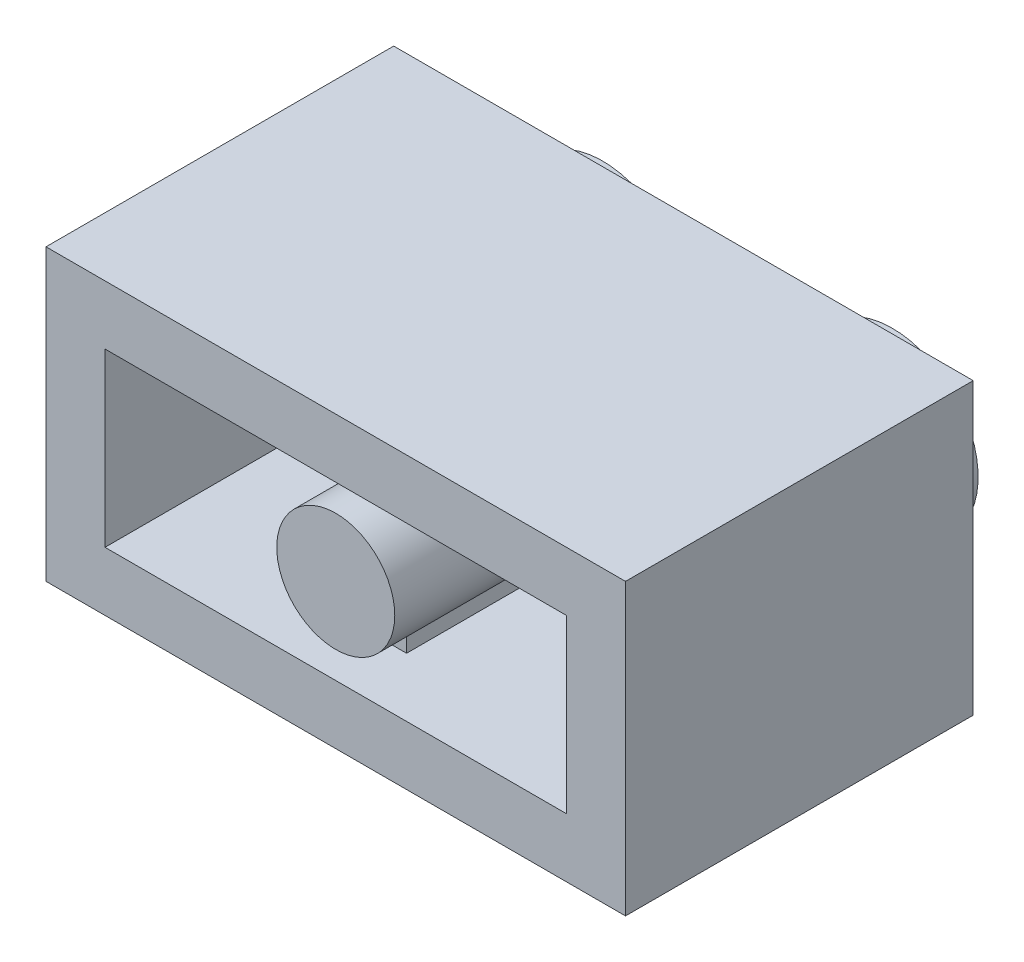
ISO-10303-21;
HEADER;
FILE_DESCRIPTION(('STEP AP214'),'2;1');
FILE_NAME('part.step','',(''),(''),'','','');
FILE_SCHEMA(('AUTOMOTIVE_DESIGN { 1 0 10303 214 1 1 1 1 }'));
ENDSEC;
DATA;
#1=APPLICATION_CONTEXT('core data for automotive mechanical design processes');
#2=APPLICATION_PROTOCOL_DEFINITION('international standard','automotive_design',2000,#1);
#3=PRODUCT_CONTEXT('',#1,'mechanical');
#4=PRODUCT('Part','Part','',(#3));
#5=PRODUCT_RELATED_PRODUCT_CATEGORY('part','',(#4));
#6=PRODUCT_DEFINITION_FORMATION('','',#4);
#7=PRODUCT_DEFINITION_CONTEXT('part definition',#1,'design');
#8=PRODUCT_DEFINITION('design','',#6,#7);
#9=PRODUCT_DEFINITION_SHAPE('','',#8);
#10=(LENGTH_UNIT() NAMED_UNIT(*) SI_UNIT(.MILLI.,.METRE.));
#11=(NAMED_UNIT(*) PLANE_ANGLE_UNIT() SI_UNIT($,.RADIAN.));
#12=(NAMED_UNIT(*) SI_UNIT($,.STERADIAN.) SOLID_ANGLE_UNIT());
#13=UNCERTAINTY_MEASURE_WITH_UNIT(LENGTH_MEASURE(1.E-05),#10,'distance_accuracy_value','');
#14=(GEOMETRIC_REPRESENTATION_CONTEXT(3) GLOBAL_UNCERTAINTY_ASSIGNED_CONTEXT((#13)) GLOBAL_UNIT_ASSIGNED_CONTEXT((#10,
#11,#12)) REPRESENTATION_CONTEXT('',''));
#15=CARTESIAN_POINT('',(0.,0.,0.));
#16=DIRECTION('',(0.,0.,1.));
#17=DIRECTION('',(1.,0.,0.));
#18=AXIS2_PLACEMENT_3D('',#15,#16,#17);
#19=CARTESIAN_POINT('',(0.,-4.0325,4.839));
#20=DIRECTION('',(0.,0.,1.));
#21=DIRECTION('',(1.,0.,0.));
#22=AXIS2_PLACEMENT_3D('',#19,#20,#21);
#23=PLANE('',#22);
#24=CARTESIAN_POINT('',(0.,0.,4.839));
#25=DIRECTION('',(0.,0.,1.));
#26=DIRECTION('',(1.,0.,0.));
#27=AXIS2_PLACEMENT_3D('',#24,#25,#26);
#28=CIRCLE('',#27,1.6425);
#29=CARTESIAN_POINT('',(1.6425,0.,4.839));
#30=VERTEX_POINT('',#29);
#31=EDGE_CURVE('E19',#30,#30,#28,.F.);
#32=ORIENTED_EDGE('',*,*,#31,.F.);
#33=EDGE_LOOP('',(#32));
#34=FACE_BOUND('',#33,.T.);
#35=ADVANCED_FACE('F16',(#34),#23,.T.);
#36=CARTESIAN_POINT('',(8.065,-4.0325,-4.839));
#37=DIRECTION('',(0.,0.,-1.));
#38=DIRECTION('',(-1.,0.,0.));
#39=AXIS2_PLACEMENT_3D('',#36,#37,#38);
#40=PLANE('',#39);
#41=CARTESIAN_POINT('',(-4.0325,0.,-4.839));
#42=DIRECTION('',(0.,0.,-1.));
#43=DIRECTION('',(-1.,0.,0.));
#44=AXIS2_PLACEMENT_3D('',#41,#42,#43);
#45=CIRCLE('',#44,1.6425);
#46=CARTESIAN_POINT('',(-5.675,0.,-4.839));
#47=VERTEX_POINT('',#46);
#48=EDGE_CURVE('E136',#47,#47,#45,.T.);
#49=ORIENTED_EDGE('',*,*,#48,.T.);
#50=EDGE_LOOP('',(#49));
#51=FACE_BOUND('',#50,.T.);
#52=ADVANCED_FACE('F271',(#51),#40,.T.);
#53=CARTESIAN_POINT('',(8.065,-4.0325,-4.839));
#54=DIRECTION('',(0.,0.,-1.));
#55=DIRECTION('',(-1.,0.,0.));
#56=AXIS2_PLACEMENT_3D('',#53,#54,#55);
#57=PLANE('',#56);
#58=CARTESIAN_POINT('',(4.0325,0.,-4.839));
#59=DIRECTION('',(0.,0.,-1.));
#60=DIRECTION('',(-1.,0.,0.));
#61=AXIS2_PLACEMENT_3D('',#58,#59,#60);
#62=CIRCLE('',#61,1.6425);
#63=CARTESIAN_POINT('',(2.39,0.,-4.839));
#64=VERTEX_POINT('',#63);
#65=EDGE_CURVE('E265',#64,#64,#62,.T.);
#66=ORIENTED_EDGE('',*,*,#65,.T.);
#67=EDGE_LOOP('',(#66));
#68=FACE_BOUND('',#67,.T.);
#69=ADVANCED_FACE('F286',(#68),#57,.T.);
#70=CARTESIAN_POINT('',(0.,0.,4.839));
#71=DIRECTION('',(0.,0.,1.));
#72=DIRECTION('',(1.,0.,0.));
#73=AXIS2_PLACEMENT_3D('',#70,#71,#72);
#74=CYLINDRICAL_SURFACE('',#73,1.6425);
#75=ORIENTED_EDGE('',*,*,#31,.T.);
#76=EDGE_LOOP('',(#75));
#77=FACE_BOUND('',#76,.T.);
#78=DIRECTION('',(0.,0.,1.));
#79=VECTOR('',#78,1.);
#80=CARTESIAN_POINT('',(-0.3285,-1.60931476100855,-3.1965));
#81=LINE('',#80,#79);
#82=CARTESIAN_POINT('',(-0.3285,-1.60931476100855,3.1965));
#83=VERTEX_POINT('',#82);
#84=CARTESIAN_POINT('',(-0.328500000000001,-1.60931476100855,-3.1965));
#85=VERTEX_POINT('',#84);
#86=EDGE_CURVE('E134',#83,#85,#81,.F.);
#87=ORIENTED_EDGE('',*,*,#86,.F.);
#88=CARTESIAN_POINT('',(0.,0.,3.1965));
#89=DIRECTION('',(0.,0.,1.));
#90=DIRECTION('',(1.,0.,0.));
#91=AXIS2_PLACEMENT_3D('',#88,#89,#90);
#92=CIRCLE('',#91,1.6425);
#93=CARTESIAN_POINT('',(0.3285,-1.60931476100855,3.1965));
#94=VERTEX_POINT('',#93);
#95=EDGE_CURVE('E125',#83,#94,#92,.T.);
#96=ORIENTED_EDGE('',*,*,#95,.T.);
#97=DIRECTION('',(0.,0.,-1.));
#98=VECTOR('',#97,1.);
#99=CARTESIAN_POINT('',(0.3285,-1.60931476100855,3.1965));
#100=LINE('',#99,#98);
#101=CARTESIAN_POINT('',(0.3285,-1.60931476100855,-3.1965));
#102=VERTEX_POINT('',#101);
#103=EDGE_CURVE('E132',#102,#94,#100,.F.);
#104=ORIENTED_EDGE('',*,*,#103,.F.);
#105=CARTESIAN_POINT('',(0.,0.,-3.1965));
#106=DIRECTION('',(0.,0.,1.));
#107=DIRECTION('',(1.,0.,0.));
#108=AXIS2_PLACEMENT_3D('',#105,#106,#107);
#109=CIRCLE('',#108,1.6425);
#110=CARTESIAN_POINT('',(0.3285,1.60931476100855,-3.1965));
#111=VERTEX_POINT('',#110);
#112=EDGE_CURVE('E161',#102,#111,#109,.T.);
#113=ORIENTED_EDGE('',*,*,#112,.T.);
#114=DIRECTION('',(0.,0.,-1.));
#115=VECTOR('',#114,1.);
#116=CARTESIAN_POINT('',(0.3285,1.60931476100855,3.1965));
#117=LINE('',#116,#115);
#118=CARTESIAN_POINT('',(0.3285,1.60931476100855,3.1965));
#119=VERTEX_POINT('',#118);
#120=EDGE_CURVE('E176',#119,#111,#117,.T.);
#121=ORIENTED_EDGE('',*,*,#120,.F.);
#122=CARTESIAN_POINT('',(0.,0.,3.1965));
#123=DIRECTION('',(0.,0.,1.));
#124=DIRECTION('',(1.,0.,0.));
#125=AXIS2_PLACEMENT_3D('',#122,#123,#124);
#126=CIRCLE('',#125,1.6425);
#127=CARTESIAN_POINT('',(-0.3285,1.60931476100855,3.1965));
#128=VERTEX_POINT('',#127);
#129=EDGE_CURVE('E216',#128,#119,#126,.F.);
#130=ORIENTED_EDGE('',*,*,#129,.F.);
#131=DIRECTION('',(0.,0.,1.));
#132=VECTOR('',#131,1.);
#133=CARTESIAN_POINT('',(-0.3285,1.60931476100855,-3.1965));
#134=LINE('',#133,#132);
#135=CARTESIAN_POINT('',(-0.328500000000001,1.60931476100855,-3.1965));
#136=VERTEX_POINT('',#135);
#137=EDGE_CURVE('E213',#136,#128,#134,.T.);
#138=ORIENTED_EDGE('',*,*,#137,.F.);
#139=CARTESIAN_POINT('',(0.,0.,-3.1965));
#140=DIRECTION('',(0.,0.,1.));
#141=DIRECTION('',(1.,0.,0.));
#142=AXIS2_PLACEMENT_3D('',#139,#140,#141);
#143=CIRCLE('',#142,1.6425);
#144=EDGE_CURVE('E167',#136,#85,#143,.T.);
#145=ORIENTED_EDGE('',*,*,#144,.T.);
#146=EDGE_LOOP('',(#87,#96,#104,#113,#121,#130,#138,#145));
#147=FACE_BOUND('',#146,.T.);
#148=ADVANCED_FACE('F130',(#77,#147),#74,.T.);
#149=CARTESIAN_POINT('',(-4.0325,0.,-4.839));
#150=DIRECTION('',(0.,0.,-1.));
#151=DIRECTION('',(-1.,0.,0.));
#152=AXIS2_PLACEMENT_3D('',#149,#150,#151);
#153=CYLINDRICAL_SURFACE('',#152,1.6425);
#154=CARTESIAN_POINT('',(-4.0325,0.,-6.619));
#155=DIRECTION('',(0.,0.,-1.));
#156=DIRECTION('',(-1.,0.,0.));
#157=AXIS2_PLACEMENT_3D('',#154,#155,#156);
#158=CIRCLE('',#157,1.6425);
#159=CARTESIAN_POINT('',(-5.675,0.,-6.619));
#160=VERTEX_POINT('',#159);
#161=EDGE_CURVE('E152',#160,#160,#158,.F.);
#162=ORIENTED_EDGE('',*,*,#161,.F.);
#163=EDGE_LOOP('',(#162));
#164=FACE_BOUND('',#163,.T.);
#165=ORIENTED_EDGE('',*,*,#48,.F.);
#166=EDGE_LOOP('',(#165));
#167=FACE_BOUND('',#166,.T.);
#168=ADVANCED_FACE('F273',(#164,#167),#153,.F.);
#169=CARTESIAN_POINT('',(4.0325,0.,-4.839));
#170=DIRECTION('',(0.,0.,-1.));
#171=DIRECTION('',(-1.,0.,0.));
#172=AXIS2_PLACEMENT_3D('',#169,#170,#171);
#173=CYLINDRICAL_SURFACE('',#172,1.6425);
#174=CARTESIAN_POINT('',(4.0325,0.,-6.619));
#175=DIRECTION('',(0.,0.,-1.));
#176=DIRECTION('',(-1.,0.,0.));
#177=AXIS2_PLACEMENT_3D('',#174,#175,#176);
#178=CIRCLE('',#177,1.6425);
#179=CARTESIAN_POINT('',(2.39,0.,-6.619));
#180=VERTEX_POINT('',#179);
#181=EDGE_CURVE('E257',#180,#180,#178,.F.);
#182=ORIENTED_EDGE('',*,*,#181,.F.);
#183=EDGE_LOOP('',(#182));
#184=FACE_BOUND('',#183,.T.);
#185=ORIENTED_EDGE('',*,*,#65,.F.);
#186=EDGE_LOOP('',(#185));
#187=FACE_BOUND('',#186,.T.);
#188=ADVANCED_FACE('F275',(#184,#187),#173,.F.);
#189=CARTESIAN_POINT('',(-0.3285,2.39,3.1965));
#190=DIRECTION('',(0.,0.,1.));
#191=DIRECTION('',(1.,0.,0.));
#192=AXIS2_PLACEMENT_3D('',#189,#190,#191);
#193=PLANE('',#192);
#194=DIRECTION('',(0.,1.,0.));
#195=VECTOR('',#194,1.);
#196=CARTESIAN_POINT('',(0.3285,2.39,3.1965));
#197=LINE('',#196,#195);
#198=CARTESIAN_POINT('',(0.3285,2.39,3.1965));
#199=VERTEX_POINT('',#198);
#200=EDGE_CURVE('E200',#199,#119,#197,.F.);
#201=ORIENTED_EDGE('',*,*,#200,.F.);
#202=DIRECTION('',(1.,0.,0.));
#203=VECTOR('',#202,1.);
#204=CARTESIAN_POINT('',(0.,2.39,3.1965));
#205=LINE('',#204,#203);
#206=CARTESIAN_POINT('',(-0.3285,2.39,3.1965));
#207=VERTEX_POINT('',#206);
#208=EDGE_CURVE('E225',#199,#207,#205,.F.);
#209=ORIENTED_EDGE('',*,*,#208,.T.);
#210=DIRECTION('',(0.,1.,0.));
#211=VECTOR('',#210,1.);
#212=CARTESIAN_POINT('',(-0.3285,2.39,3.1965));
#213=LINE('',#212,#211);
#214=EDGE_CURVE('E215',#128,#207,#213,.T.);
#215=ORIENTED_EDGE('',*,*,#214,.F.);
#216=ORIENTED_EDGE('',*,*,#129,.T.);
#217=EDGE_LOOP('',(#201,#209,#215,#216));
#218=FACE_BOUND('',#217,.T.);
#219=ADVANCED_FACE('F283',(#218),#193,.T.);
#220=CARTESIAN_POINT('',(-0.3285,2.39,-3.1965));
#221=DIRECTION('',(-1.,0.,0.));
#222=DIRECTION('',(0.,0.,1.));
#223=AXIS2_PLACEMENT_3D('',#220,#221,#222);
#224=PLANE('',#223);
#225=ORIENTED_EDGE('',*,*,#214,.T.);
#226=DIRECTION('',(0.,0.,1.));
#227=VECTOR('',#226,1.);
#228=CARTESIAN_POINT('',(-0.3285,2.39,0.));
#229=LINE('',#228,#227);
#230=CARTESIAN_POINT('',(-0.328500000000001,2.39,-3.1965));
#231=VERTEX_POINT('',#230);
#232=EDGE_CURVE('E220',#207,#231,#229,.F.);
#233=ORIENTED_EDGE('',*,*,#232,.T.);
#234=DIRECTION('',(0.,1.,0.));
#235=VECTOR('',#234,1.);
#236=CARTESIAN_POINT('',(-0.328500000000001,-4.0325,-3.1965));
#237=LINE('',#236,#235);
#238=EDGE_CURVE('E164',#231,#136,#237,.F.);
#239=ORIENTED_EDGE('',*,*,#238,.T.);
#240=ORIENTED_EDGE('',*,*,#137,.T.);
#241=EDGE_LOOP('',(#225,#233,#239,#240));
#242=FACE_BOUND('',#241,.T.);
#243=ADVANCED_FACE('F369',(#242),#224,.T.);
#244=CARTESIAN_POINT('',(0.3285,2.39,3.1965));
#245=DIRECTION('',(1.,0.,0.));
#246=DIRECTION('',(0.,0.,-1.));
#247=AXIS2_PLACEMENT_3D('',#244,#245,#246);
#248=PLANE('',#247);
#249=DIRECTION('',(0.,1.,0.));
#250=VECTOR('',#249,1.);
#251=CARTESIAN_POINT('',(0.3285,-4.0325,-3.1965));
#252=LINE('',#251,#250);
#253=CARTESIAN_POINT('',(0.3285,2.39,-3.1965));
#254=VERTEX_POINT('',#253);
#255=EDGE_CURVE('E159',#111,#254,#252,.T.);
#256=ORIENTED_EDGE('',*,*,#255,.T.);
#257=DIRECTION('',(0.,0.,1.));
#258=VECTOR('',#257,1.);
#259=CARTESIAN_POINT('',(0.3285,2.39,0.));
#260=LINE('',#259,#258);
#261=EDGE_CURVE('E201',#254,#199,#260,.T.);
#262=ORIENTED_EDGE('',*,*,#261,.T.);
#263=ORIENTED_EDGE('',*,*,#200,.T.);
#264=ORIENTED_EDGE('',*,*,#120,.T.);
#265=EDGE_LOOP('',(#256,#262,#263,#264));
#266=FACE_BOUND('',#265,.T.);
#267=ADVANCED_FACE('F365',(#266),#248,.T.);
#268=CARTESIAN_POINT('',(-0.3285,2.39,-3.1965));
#269=DIRECTION('',(-1.,0.,0.));
#270=DIRECTION('',(0.,0.,1.));
#271=AXIS2_PLACEMENT_3D('',#268,#269,#270);
#272=PLANE('',#271);
#273=DIRECTION('',(0.,1.,0.));
#274=VECTOR('',#273,1.);
#275=CARTESIAN_POINT('',(-0.328500000000001,-4.0325,-3.1965));
#276=LINE('',#275,#274);
#277=CARTESIAN_POINT('',(-0.3285,-2.39,-3.1965));
#278=VERTEX_POINT('',#277);
#279=EDGE_CURVE('E168',#85,#278,#276,.F.);
#280=ORIENTED_EDGE('',*,*,#279,.T.);
#281=DIRECTION('',(0.,0.,1.));
#282=VECTOR('',#281,1.);
#283=CARTESIAN_POINT('',(-0.3285,-2.39,0.));
#284=LINE('',#283,#282);
#285=CARTESIAN_POINT('',(-0.3285,-2.39,3.1965));
#286=VERTEX_POINT('',#285);
#287=EDGE_CURVE('E182',#286,#278,#284,.F.);
#288=ORIENTED_EDGE('',*,*,#287,.F.);
#289=DIRECTION('',(0.,1.,0.));
#290=VECTOR('',#289,1.);
#291=CARTESIAN_POINT('',(-0.3285,2.39,3.1965));
#292=LINE('',#291,#290);
#293=EDGE_CURVE('E150',#83,#286,#292,.F.);
#294=ORIENTED_EDGE('',*,*,#293,.F.);
#295=ORIENTED_EDGE('',*,*,#86,.T.);
#296=EDGE_LOOP('',(#280,#288,#294,#295));
#297=FACE_BOUND('',#296,.T.);
#298=ADVANCED_FACE('F361',(#297),#272,.T.);
#299=CARTESIAN_POINT('',(8.065,-4.0325,-3.1965));
#300=DIRECTION('',(0.,0.,-1.));
#301=DIRECTION('',(-1.,0.,0.));
#302=AXIS2_PLACEMENT_3D('',#299,#300,#301);
#303=PLANE('',#302);
#304=ORIENTED_EDGE('',*,*,#144,.F.);
#305=ORIENTED_EDGE('',*,*,#238,.F.);
#306=DIRECTION('',(1.,0.,0.));
#307=VECTOR('',#306,1.);
#308=CARTESIAN_POINT('',(0.,2.39,-3.1965));
#309=LINE('',#308,#307);
#310=CARTESIAN_POINT('',(-6.4225,2.39,-3.1965));
#311=VERTEX_POINT('',#310);
#312=EDGE_CURVE('E217',#231,#311,#309,.F.);
#313=ORIENTED_EDGE('',*,*,#312,.T.);
#314=DIRECTION('',(0.,1.,0.));
#315=VECTOR('',#314,1.);
#316=CARTESIAN_POINT('',(-6.4225,-4.0325,-3.1965));
#317=LINE('',#316,#315);
#318=CARTESIAN_POINT('',(-6.4225,-2.39,-3.1965));
#319=VERTEX_POINT('',#318);
#320=EDGE_CURVE('E238',#311,#319,#317,.F.);
#321=ORIENTED_EDGE('',*,*,#320,.T.);
#322=DIRECTION('',(1.,0.,0.));
#323=VECTOR('',#322,1.);
#324=CARTESIAN_POINT('',(0.,-2.39,-3.1965));
#325=LINE('',#324,#323);
#326=EDGE_CURVE('E184',#278,#319,#325,.F.);
#327=ORIENTED_EDGE('',*,*,#326,.F.);
#328=ORIENTED_EDGE('',*,*,#279,.F.);
#329=EDGE_LOOP('',(#304,#305,#313,#321,#327,#328));
#330=FACE_BOUND('',#329,.T.);
#331=ADVANCED_FACE('F357',(#330),#303,.F.);
#332=CARTESIAN_POINT('',(8.065,-4.0325,-3.1965));
#333=DIRECTION('',(0.,0.,-1.));
#334=DIRECTION('',(-1.,0.,0.));
#335=AXIS2_PLACEMENT_3D('',#332,#333,#334);
#336=PLANE('',#335);
#337=DIRECTION('',(0.,1.,0.));
#338=VECTOR('',#337,1.);
#339=CARTESIAN_POINT('',(6.4225,-4.0325,-3.1965));
#340=LINE('',#339,#338);
#341=CARTESIAN_POINT('',(6.4225,-2.39,-3.1965));
#342=VERTEX_POINT('',#341);
#343=CARTESIAN_POINT('',(6.4225,2.39,-3.1965));
#344=VERTEX_POINT('',#343);
#345=EDGE_CURVE('E204',#342,#344,#340,.T.);
#346=ORIENTED_EDGE('',*,*,#345,.T.);
#347=DIRECTION('',(1.,0.,0.));
#348=VECTOR('',#347,1.);
#349=CARTESIAN_POINT('',(0.,2.39,-3.1965));
#350=LINE('',#349,#348);
#351=EDGE_CURVE('E205',#344,#254,#350,.F.);
#352=ORIENTED_EDGE('',*,*,#351,.T.);
#353=ORIENTED_EDGE('',*,*,#255,.F.);
#354=ORIENTED_EDGE('',*,*,#112,.F.);
#355=DIRECTION('',(0.,1.,0.));
#356=VECTOR('',#355,1.);
#357=CARTESIAN_POINT('',(0.3285,2.39,-3.1965));
#358=LINE('',#357,#356);
#359=CARTESIAN_POINT('',(0.3285,-2.39,-3.1965));
#360=VERTEX_POINT('',#359);
#361=EDGE_CURVE('E145',#360,#102,#358,.T.);
#362=ORIENTED_EDGE('',*,*,#361,.F.);
#363=DIRECTION('',(1.,0.,0.));
#364=VECTOR('',#363,1.);
#365=CARTESIAN_POINT('',(0.,-2.39,-3.1965));
#366=LINE('',#365,#364);
#367=EDGE_CURVE('E189',#342,#360,#366,.F.);
#368=ORIENTED_EDGE('',*,*,#367,.F.);
#369=EDGE_LOOP('',(#346,#352,#353,#354,#362,#368));
#370=FACE_BOUND('',#369,.T.);
#371=ADVANCED_FACE('F354',(#370),#336,.F.);
#372=CARTESIAN_POINT('',(0.3285,2.39,3.1965));
#373=DIRECTION('',(1.,0.,0.));
#374=DIRECTION('',(0.,0.,-1.));
#375=AXIS2_PLACEMENT_3D('',#372,#373,#374);
#376=PLANE('',#375);
#377=DIRECTION('',(0.,1.,0.));
#378=VECTOR('',#377,1.);
#379=CARTESIAN_POINT('',(0.3285,2.39,3.1965));
#380=LINE('',#379,#378);
#381=CARTESIAN_POINT('',(0.3285,-2.39,3.1965));
#382=VERTEX_POINT('',#381);
#383=EDGE_CURVE('E142',#382,#94,#380,.T.);
#384=ORIENTED_EDGE('',*,*,#383,.F.);
#385=DIRECTION('',(0.,0.,1.));
#386=VECTOR('',#385,1.);
#387=CARTESIAN_POINT('',(0.3285,-2.39,0.));
#388=LINE('',#387,#386);
#389=EDGE_CURVE('E179',#360,#382,#388,.T.);
#390=ORIENTED_EDGE('',*,*,#389,.F.);
#391=ORIENTED_EDGE('',*,*,#361,.T.);
#392=ORIENTED_EDGE('',*,*,#103,.T.);
#393=EDGE_LOOP('',(#384,#390,#391,#392));
#394=FACE_BOUND('',#393,.T.);
#395=ADVANCED_FACE('F140',(#394),#376,.T.);
#396=CARTESIAN_POINT('',(-0.3285,2.39,3.1965));
#397=DIRECTION('',(0.,0.,1.));
#398=DIRECTION('',(1.,0.,0.));
#399=AXIS2_PLACEMENT_3D('',#396,#397,#398);
#400=PLANE('',#399);
#401=ORIENTED_EDGE('',*,*,#293,.T.);
#402=DIRECTION('',(1.,0.,0.));
#403=VECTOR('',#402,1.);
#404=CARTESIAN_POINT('',(0.,-2.39,3.1965));
#405=LINE('',#404,#403);
#406=EDGE_CURVE('E149',#382,#286,#405,.F.);
#407=ORIENTED_EDGE('',*,*,#406,.F.);
#408=ORIENTED_EDGE('',*,*,#383,.T.);
#409=ORIENTED_EDGE('',*,*,#95,.F.);
#410=EDGE_LOOP('',(#401,#407,#408,#409));
#411=FACE_BOUND('',#410,.T.);
#412=ADVANCED_FACE('F147',(#411),#400,.T.);
#413=CARTESIAN_POINT('',(0.,-4.0325,-6.619));
#414=DIRECTION('',(0.,0.,-1.));
#415=DIRECTION('',(-1.,0.,0.));
#416=AXIS2_PLACEMENT_3D('',#413,#414,#415);
#417=PLANE('',#416);
#418=ORIENTED_EDGE('',*,*,#161,.T.);
#419=EDGE_LOOP('',(#418));
#420=FACE_BOUND('',#419,.T.);
#421=CARTESIAN_POINT('',(-4.0325,0.,-6.619));
#422=DIRECTION('',(0.,0.,-1.));
#423=DIRECTION('',(-1.,0.,0.));
#424=AXIS2_PLACEMENT_3D('',#421,#422,#423);
#425=CIRCLE('',#424,2.39);
#426=CARTESIAN_POINT('',(-6.4225,0.,-6.619));
#427=VERTEX_POINT('',#426);
#428=EDGE_CURVE('E178',#427,#427,#425,.F.);
#429=ORIENTED_EDGE('',*,*,#428,.F.);
#430=EDGE_LOOP('',(#429));
#431=FACE_BOUND('',#430,.T.);
#432=ADVANCED_FACE('F345',(#420,#431),#417,.T.);
#433=CARTESIAN_POINT('',(0.,-4.0325,-6.619));
#434=DIRECTION('',(0.,0.,-1.));
#435=DIRECTION('',(-1.,0.,0.));
#436=AXIS2_PLACEMENT_3D('',#433,#434,#435);
#437=PLANE('',#436);
#438=ORIENTED_EDGE('',*,*,#181,.T.);
#439=EDGE_LOOP('',(#438));
#440=FACE_BOUND('',#439,.T.);
#441=CARTESIAN_POINT('',(4.0325,0.,-6.619));
#442=DIRECTION('',(0.,0.,-1.));
#443=DIRECTION('',(-1.,0.,0.));
#444=AXIS2_PLACEMENT_3D('',#441,#442,#443);
#445=CIRCLE('',#444,2.39);
#446=CARTESIAN_POINT('',(1.6425,0.,-6.619));
#447=VERTEX_POINT('',#446);
#448=EDGE_CURVE('E251',#447,#447,#445,.F.);
#449=ORIENTED_EDGE('',*,*,#448,.F.);
#450=EDGE_LOOP('',(#449));
#451=FACE_BOUND('',#450,.T.);
#452=ADVANCED_FACE('F341',(#440,#451),#437,.T.);
#453=CARTESIAN_POINT('',(-6.4225,-4.0325,-4.839));
#454=DIRECTION('',(-1.,0.,0.));
#455=DIRECTION('',(0.,0.,1.));
#456=AXIS2_PLACEMENT_3D('',#453,#454,#455);
#457=PLANE('',#456);
#458=ORIENTED_EDGE('',*,*,#320,.F.);
#459=DIRECTION('',(0.,0.,1.));
#460=VECTOR('',#459,1.);
#461=CARTESIAN_POINT('',(-6.4225,2.39,0.));
#462=LINE('',#461,#460);
#463=CARTESIAN_POINT('',(-6.4225,2.39,4.839));
#464=VERTEX_POINT('',#463);
#465=EDGE_CURVE('E210',#311,#464,#462,.T.);
#466=ORIENTED_EDGE('',*,*,#465,.T.);
#467=DIRECTION('',(0.,1.,0.));
#468=VECTOR('',#467,1.);
#469=CARTESIAN_POINT('',(-6.4225,-4.0325,4.839));
#470=LINE('',#469,#468);
#471=CARTESIAN_POINT('',(-6.4225,-2.39,4.839));
#472=VERTEX_POINT('',#471);
#473=EDGE_CURVE('E404',#472,#464,#470,.T.);
#474=ORIENTED_EDGE('',*,*,#473,.F.);
#475=DIRECTION('',(0.,0.,1.));
#476=VECTOR('',#475,1.);
#477=CARTESIAN_POINT('',(-6.4225,-2.39,0.));
#478=LINE('',#477,#476);
#479=EDGE_CURVE('E229',#319,#472,#478,.T.);
#480=ORIENTED_EDGE('',*,*,#479,.F.);
#481=EDGE_LOOP('',(#458,#466,#474,#480));
#482=FACE_BOUND('',#481,.T.);
#483=ADVANCED_FACE('F337',(#482),#457,.F.);
#484=CARTESIAN_POINT('',(0.,2.39,0.));
#485=DIRECTION('',(0.,1.,0.));
#486=DIRECTION('',(0.,0.,1.));
#487=AXIS2_PLACEMENT_3D('',#484,#485,#486);
#488=PLANE('',#487);
#489=ORIENTED_EDGE('',*,*,#351,.F.);
#490=DIRECTION('',(0.,0.,-1.));
#491=VECTOR('',#490,1.);
#492=CARTESIAN_POINT('',(6.4225,2.39,4.839));
#493=LINE('',#492,#491);
#494=CARTESIAN_POINT('',(6.4225,2.39,4.839));
#495=VERTEX_POINT('',#494);
#496=EDGE_CURVE('E185',#344,#495,#493,.F.);
#497=ORIENTED_EDGE('',*,*,#496,.T.);
#498=DIRECTION('',(1.,0.,0.));
#499=VECTOR('',#498,1.);
#500=CARTESIAN_POINT('',(-8.065,2.39,4.839));
#501=LINE('',#500,#499);
#502=EDGE_CURVE('E415',#464,#495,#501,.T.);
#503=ORIENTED_EDGE('',*,*,#502,.F.);
#504=ORIENTED_EDGE('',*,*,#465,.F.);
#505=ORIENTED_EDGE('',*,*,#312,.F.);
#506=ORIENTED_EDGE('',*,*,#232,.F.);
#507=ORIENTED_EDGE('',*,*,#208,.F.);
#508=ORIENTED_EDGE('',*,*,#261,.F.);
#509=EDGE_LOOP('',(#489,#497,#503,#504,#505,#506,#507,#508));
#510=FACE_BOUND('',#509,.T.);
#511=ADVANCED_FACE('F333',(#510),#488,.F.);
#512=CARTESIAN_POINT('',(6.4225,-4.0325,4.839));
#513=DIRECTION('',(1.,0.,0.));
#514=DIRECTION('',(0.,0.,-1.));
#515=AXIS2_PLACEMENT_3D('',#512,#513,#514);
#516=PLANE('',#515);
#517=ORIENTED_EDGE('',*,*,#345,.F.);
#518=DIRECTION('',(0.,0.,1.));
#519=VECTOR('',#518,1.);
#520=CARTESIAN_POINT('',(6.4225,-2.39,0.));
#521=LINE('',#520,#519);
#522=CARTESIAN_POINT('',(6.4225,-2.39,4.839));
#523=VERTEX_POINT('',#522);
#524=EDGE_CURVE('E196',#523,#342,#521,.F.);
#525=ORIENTED_EDGE('',*,*,#524,.F.);
#526=DIRECTION('',(0.,1.,0.));
#527=VECTOR('',#526,1.);
#528=CARTESIAN_POINT('',(6.4225,-4.0325,4.839));
#529=LINE('',#528,#527);
#530=EDGE_CURVE('E417',#495,#523,#529,.F.);
#531=ORIENTED_EDGE('',*,*,#530,.F.);
#532=ORIENTED_EDGE('',*,*,#496,.F.);
#533=EDGE_LOOP('',(#517,#525,#531,#532));
#534=FACE_BOUND('',#533,.T.);
#535=ADVANCED_FACE('F329',(#534),#516,.F.);
#536=CARTESIAN_POINT('',(0.,-2.39,0.));
#537=DIRECTION('',(0.,1.,0.));
#538=DIRECTION('',(0.,0.,1.));
#539=AXIS2_PLACEMENT_3D('',#536,#537,#538);
#540=PLANE('',#539);
#541=ORIENTED_EDGE('',*,*,#389,.T.);
#542=ORIENTED_EDGE('',*,*,#406,.T.);
#543=ORIENTED_EDGE('',*,*,#287,.T.);
#544=ORIENTED_EDGE('',*,*,#326,.T.);
#545=ORIENTED_EDGE('',*,*,#479,.T.);
#546=DIRECTION('',(1.,0.,0.));
#547=VECTOR('',#546,1.);
#548=CARTESIAN_POINT('',(-8.065,-2.39,4.839));
#549=LINE('',#548,#547);
#550=EDGE_CURVE('E419',#523,#472,#549,.F.);
#551=ORIENTED_EDGE('',*,*,#550,.F.);
#552=ORIENTED_EDGE('',*,*,#524,.T.);
#553=ORIENTED_EDGE('',*,*,#367,.T.);
#554=EDGE_LOOP('',(#541,#542,#543,#544,#545,#551,#552,#553));
#555=FACE_BOUND('',#554,.T.);
#556=ADVANCED_FACE('F325',(#555),#540,.T.);
#557=CARTESIAN_POINT('',(0.,4.0325,0.));
#558=DIRECTION('',(0.,1.,0.));
#559=DIRECTION('',(0.,0.,1.));
#560=AXIS2_PLACEMENT_3D('',#557,#558,#559);
#561=PLANE('',#560);
#562=DIRECTION('',(-1.,0.,0.));
#563=VECTOR('',#562,1.);
#564=CARTESIAN_POINT('',(8.065,4.0325,-4.839));
#565=LINE('',#564,#563);
#566=CARTESIAN_POINT('',(-8.065,4.0325,-4.839));
#567=VERTEX_POINT('',#566);
#568=CARTESIAN_POINT('',(8.065,4.0325,-4.839));
#569=VERTEX_POINT('',#568);
#570=EDGE_CURVE('E428',#567,#569,#565,.F.);
#571=ORIENTED_EDGE('',*,*,#570,.F.);
#572=DIRECTION('',(0.,0.,1.));
#573=VECTOR('',#572,1.);
#574=CARTESIAN_POINT('',(-8.065,4.0325,-4.839));
#575=LINE('',#574,#573);
#576=CARTESIAN_POINT('',(-8.065,4.0325,4.839));
#577=VERTEX_POINT('',#576);
#578=EDGE_CURVE('E254',#577,#567,#575,.F.);
#579=ORIENTED_EDGE('',*,*,#578,.F.);
#580=DIRECTION('',(1.,0.,0.));
#581=VECTOR('',#580,1.);
#582=CARTESIAN_POINT('',(-8.065,4.0325,4.839));
#583=LINE('',#582,#581);
#584=CARTESIAN_POINT('',(8.065,4.0325,4.839));
#585=VERTEX_POINT('',#584);
#586=EDGE_CURVE('E410',#585,#577,#583,.F.);
#587=ORIENTED_EDGE('',*,*,#586,.F.);
#588=DIRECTION('',(0.,0.,-1.));
#589=VECTOR('',#588,1.);
#590=CARTESIAN_POINT('',(8.065,4.0325,4.839));
#591=LINE('',#590,#589);
#592=EDGE_CURVE('E421',#569,#585,#591,.F.);
#593=ORIENTED_EDGE('',*,*,#592,.F.);
#594=EDGE_LOOP('',(#571,#579,#587,#593));
#595=FACE_BOUND('',#594,.T.);
#596=ADVANCED_FACE('F321',(#595),#561,.T.);
#597=CARTESIAN_POINT('',(-4.0325,0.,-4.839));
#598=DIRECTION('',(0.,0.,-1.));
#599=DIRECTION('',(-1.,0.,0.));
#600=AXIS2_PLACEMENT_3D('',#597,#598,#599);
#601=CYLINDRICAL_SURFACE('',#600,2.39);
#602=ORIENTED_EDGE('',*,*,#428,.T.);
#603=EDGE_LOOP('',(#602));
#604=FACE_BOUND('',#603,.T.);
#605=CARTESIAN_POINT('',(-4.0325,0.,-4.839));
#606=DIRECTION('',(0.,0.,-1.));
#607=DIRECTION('',(-1.,0.,0.));
#608=AXIS2_PLACEMENT_3D('',#605,#606,#607);
#609=CIRCLE('',#608,2.39);
#610=CARTESIAN_POINT('',(-6.4225,0.,-4.839));
#611=VERTEX_POINT('',#610);
#612=EDGE_CURVE('E248',#611,#611,#609,.F.);
#613=ORIENTED_EDGE('',*,*,#612,.F.);
#614=EDGE_LOOP('',(#613));
#615=FACE_BOUND('',#614,.T.);
#616=ADVANCED_FACE('F317',(#604,#615),#601,.T.);
#617=CARTESIAN_POINT('',(4.0325,0.,-4.839));
#618=DIRECTION('',(0.,0.,-1.));
#619=DIRECTION('',(-1.,0.,0.));
#620=AXIS2_PLACEMENT_3D('',#617,#618,#619);
#621=CYLINDRICAL_SURFACE('',#620,2.39);
#622=ORIENTED_EDGE('',*,*,#448,.T.);
#623=EDGE_LOOP('',(#622));
#624=FACE_BOUND('',#623,.T.);
#625=CARTESIAN_POINT('',(4.0325,0.,-4.839));
#626=DIRECTION('',(0.,0.,-1.));
#627=DIRECTION('',(-1.,0.,0.));
#628=AXIS2_PLACEMENT_3D('',#625,#626,#627);
#629=CIRCLE('',#628,2.39);
#630=CARTESIAN_POINT('',(1.6425,0.,-4.839));
#631=VERTEX_POINT('',#630);
#632=EDGE_CURVE('E244',#631,#631,#629,.F.);
#633=ORIENTED_EDGE('',*,*,#632,.F.);
#634=EDGE_LOOP('',(#633));
#635=FACE_BOUND('',#634,.T.);
#636=ADVANCED_FACE('F313',(#624,#635),#621,.T.);
#637=CARTESIAN_POINT('',(-8.065,-4.0325,-4.839));
#638=DIRECTION('',(-1.,0.,0.));
#639=DIRECTION('',(0.,0.,1.));
#640=AXIS2_PLACEMENT_3D('',#637,#638,#639);
#641=PLANE('',#640);
#642=DIRECTION('',(0.,1.,0.));
#643=VECTOR('',#642,1.);
#644=CARTESIAN_POINT('',(-8.065,-4.0325,-4.839));
#645=LINE('',#644,#643);
#646=CARTESIAN_POINT('',(-8.065,-4.0325,-4.839));
#647=VERTEX_POINT('',#646);
#648=EDGE_CURVE('E425',#647,#567,#645,.T.);
#649=ORIENTED_EDGE('',*,*,#648,.F.);
#650=DIRECTION('',(0.,0.,1.));
#651=VECTOR('',#650,1.);
#652=CARTESIAN_POINT('',(-8.065,-4.0325,0.));
#653=LINE('',#652,#651);
#654=CARTESIAN_POINT('',(-8.065,-4.0325,4.839));
#655=VERTEX_POINT('',#654);
#656=EDGE_CURVE('E247',#647,#655,#653,.T.);
#657=ORIENTED_EDGE('',*,*,#656,.T.);
#658=DIRECTION('',(0.,1.,0.));
#659=VECTOR('',#658,1.);
#660=CARTESIAN_POINT('',(-8.065,-4.0325,4.839));
#661=LINE('',#660,#659);
#662=EDGE_CURVE('E412',#577,#655,#661,.F.);
#663=ORIENTED_EDGE('',*,*,#662,.F.);
#664=ORIENTED_EDGE('',*,*,#578,.T.);
#665=EDGE_LOOP('',(#649,#657,#663,#664));
#666=FACE_BOUND('',#665,.T.);
#667=ADVANCED_FACE('F309',(#666),#641,.T.);
#668=CARTESIAN_POINT('',(-8.065,-4.0325,4.839));
#669=DIRECTION('',(0.,0.,1.));
#670=DIRECTION('',(1.,0.,0.));
#671=AXIS2_PLACEMENT_3D('',#668,#669,#670);
#672=PLANE('',#671);
#673=ORIENTED_EDGE('',*,*,#530,.T.);
#674=ORIENTED_EDGE('',*,*,#550,.T.);
#675=ORIENTED_EDGE('',*,*,#473,.T.);
#676=ORIENTED_EDGE('',*,*,#502,.T.);
#677=EDGE_LOOP('',(#673,#674,#675,#676));
#678=FACE_BOUND('',#677,.T.);
#679=ORIENTED_EDGE('',*,*,#662,.T.);
#680=DIRECTION('',(1.,0.,0.));
#681=VECTOR('',#680,1.);
#682=CARTESIAN_POINT('',(0.,-4.0325,4.839));
#683=LINE('',#682,#681);
#684=CARTESIAN_POINT('',(8.065,-4.0325,4.839));
#685=VERTEX_POINT('',#684);
#686=EDGE_CURVE('E433',#655,#685,#683,.T.);
#687=ORIENTED_EDGE('',*,*,#686,.T.);
#688=DIRECTION('',(0.,1.,0.));
#689=VECTOR('',#688,1.);
#690=CARTESIAN_POINT('',(8.065,-4.0325,4.839));
#691=LINE('',#690,#689);
#692=EDGE_CURVE('E423',#585,#685,#691,.F.);
#693=ORIENTED_EDGE('',*,*,#692,.F.);
#694=ORIENTED_EDGE('',*,*,#586,.T.);
#695=EDGE_LOOP('',(#679,#687,#693,#694));
#696=FACE_BOUND('',#695,.T.);
#697=ADVANCED_FACE('F305',(#678,#696),#672,.T.);
#698=CARTESIAN_POINT('',(8.065,-4.0325,4.839));
#699=DIRECTION('',(1.,0.,0.));
#700=DIRECTION('',(0.,0.,-1.));
#701=AXIS2_PLACEMENT_3D('',#698,#699,#700);
#702=PLANE('',#701);
#703=ORIENTED_EDGE('',*,*,#692,.T.);
#704=DIRECTION('',(0.,0.,1.));
#705=VECTOR('',#704,1.);
#706=CARTESIAN_POINT('',(8.065,-4.0325,0.));
#707=LINE('',#706,#705);
#708=CARTESIAN_POINT('',(8.065,-4.0325,-4.839));
#709=VERTEX_POINT('',#708);
#710=EDGE_CURVE('E25',#685,#709,#707,.F.);
#711=ORIENTED_EDGE('',*,*,#710,.T.);
#712=DIRECTION('',(0.,1.,0.));
#713=VECTOR('',#712,1.);
#714=CARTESIAN_POINT('',(8.065,-4.0325,-4.839));
#715=LINE('',#714,#713);
#716=EDGE_CURVE('E33',#569,#709,#715,.F.);
#717=ORIENTED_EDGE('',*,*,#716,.F.);
#718=ORIENTED_EDGE('',*,*,#592,.T.);
#719=EDGE_LOOP('',(#703,#711,#717,#718));
#720=FACE_BOUND('',#719,.T.);
#721=ADVANCED_FACE('F298',(#720),#702,.T.);
#722=CARTESIAN_POINT('',(8.065,-4.0325,-4.839));
#723=DIRECTION('',(0.,0.,-1.));
#724=DIRECTION('',(-1.,0.,0.));
#725=AXIS2_PLACEMENT_3D('',#722,#723,#724);
#726=PLANE('',#725);
#727=ORIENTED_EDGE('',*,*,#632,.T.);
#728=EDGE_LOOP('',(#727));
#729=FACE_BOUND('',#728,.T.);
#730=ORIENTED_EDGE('',*,*,#612,.T.);
#731=EDGE_LOOP('',(#730));
#732=FACE_BOUND('',#731,.T.);
#733=ORIENTED_EDGE('',*,*,#716,.T.);
#734=DIRECTION('',(1.,0.,0.));
#735=VECTOR('',#734,1.);
#736=CARTESIAN_POINT('',(0.,-4.0325,-4.839));
#737=LINE('',#736,#735);
#738=EDGE_CURVE('E10',#709,#647,#737,.F.);
#739=ORIENTED_EDGE('',*,*,#738,.T.);
#740=ORIENTED_EDGE('',*,*,#648,.T.);
#741=ORIENTED_EDGE('',*,*,#570,.T.);
#742=EDGE_LOOP('',(#733,#739,#740,#741));
#743=FACE_BOUND('',#742,.T.);
#744=ADVANCED_FACE('F292',(#729,#732,#743),#726,.T.);
#745=CARTESIAN_POINT('',(0.,-4.0325,0.));
#746=DIRECTION('',(0.,1.,0.));
#747=DIRECTION('',(0.,0.,1.));
#748=AXIS2_PLACEMENT_3D('',#745,#746,#747);
#749=PLANE('',#748);
#750=ORIENTED_EDGE('',*,*,#710,.F.);
#751=ORIENTED_EDGE('',*,*,#686,.F.);
#752=ORIENTED_EDGE('',*,*,#656,.F.);
#753=ORIENTED_EDGE('',*,*,#738,.F.);
#754=EDGE_LOOP('',(#750,#751,#752,#753));
#755=FACE_BOUND('',#754,.T.);
#756=ADVANCED_FACE('F290',(#755),#749,.F.);
#757=CLOSED_SHELL('',(#35,#52,#69,#148,#168,#188,#219,#243,#267,#298,#331,#371,#395,#412,#432,
#452,#483,#511,#535,#556,#596,#616,#636,#667,#697,#721,#744,#756));
#758=MANIFOLD_SOLID_BREP('B1',#757);
#759=ADVANCED_BREP_SHAPE_REPRESENTATION('',(#18,#758),#14);
#760=SHAPE_DEFINITION_REPRESENTATION(#9,#759);
ENDSEC;
END-ISO-10303-21;
